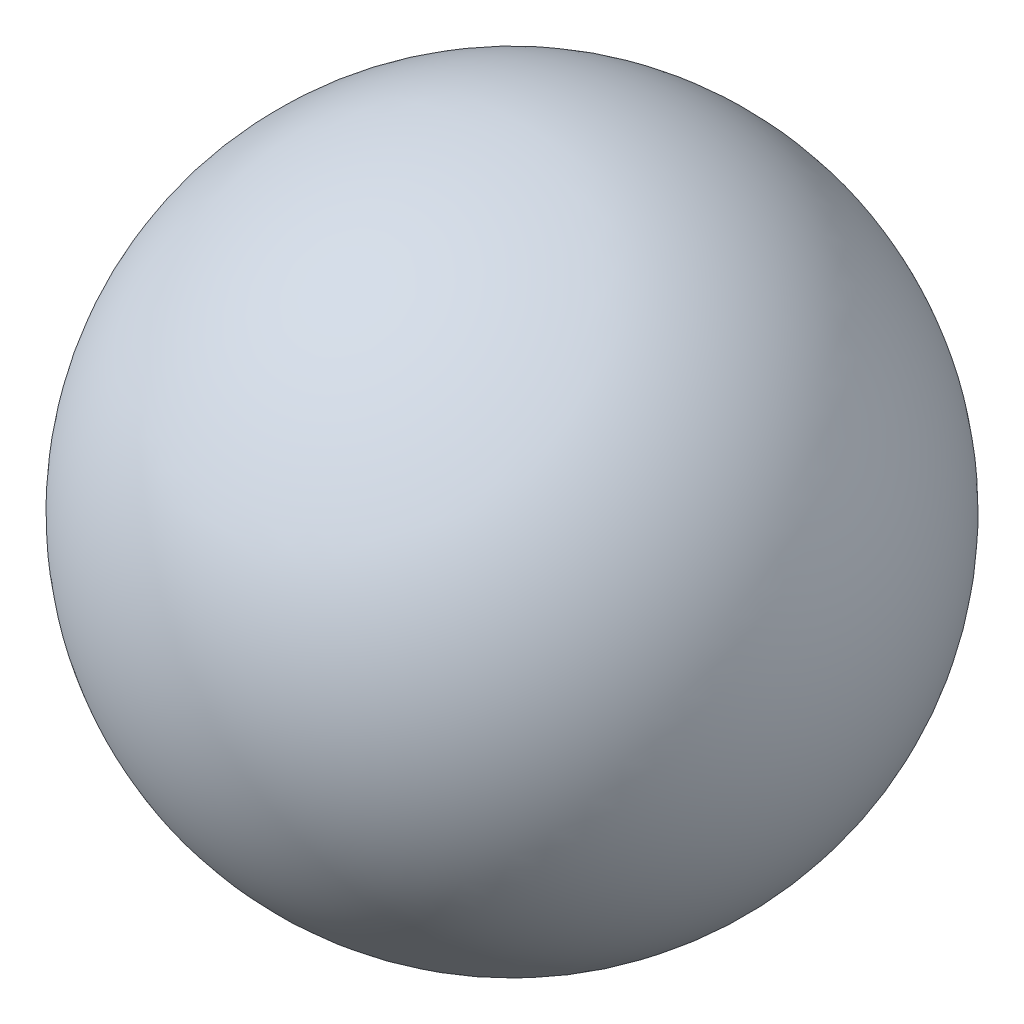
ISO-10303-21;
HEADER;
FILE_DESCRIPTION(('STEP AP214'),'2;1');
FILE_NAME('part.step','',(''),(''),'','','');
FILE_SCHEMA(('AUTOMOTIVE_DESIGN { 1 0 10303 214 1 1 1 1 }'));
ENDSEC;
DATA;
#1=APPLICATION_CONTEXT('core data for automotive mechanical design processes');
#2=APPLICATION_PROTOCOL_DEFINITION('international standard','automotive_design',2000,#1);
#3=PRODUCT_CONTEXT('',#1,'mechanical');
#4=PRODUCT('Part','Part','',(#3));
#5=PRODUCT_RELATED_PRODUCT_CATEGORY('part','',(#4));
#6=PRODUCT_DEFINITION_FORMATION('','',#4);
#7=PRODUCT_DEFINITION_CONTEXT('part definition',#1,'design');
#8=PRODUCT_DEFINITION('design','',#6,#7);
#9=PRODUCT_DEFINITION_SHAPE('','',#8);
#10=(LENGTH_UNIT() NAMED_UNIT(*) SI_UNIT(.MILLI.,.METRE.));
#11=(NAMED_UNIT(*) PLANE_ANGLE_UNIT() SI_UNIT($,.RADIAN.));
#12=(NAMED_UNIT(*) SI_UNIT($,.STERADIAN.) SOLID_ANGLE_UNIT());
#13=UNCERTAINTY_MEASURE_WITH_UNIT(LENGTH_MEASURE(1.E-05),#10,'distance_accuracy_value','');
#14=(GEOMETRIC_REPRESENTATION_CONTEXT(3) GLOBAL_UNCERTAINTY_ASSIGNED_CONTEXT((#13)) GLOBAL_UNIT_ASSIGNED_CONTEXT((#10,
#11,#12)) REPRESENTATION_CONTEXT('',''));
#15=CARTESIAN_POINT('',(0.,0.,0.));
#16=DIRECTION('',(0.,0.,1.));
#17=DIRECTION('',(1.,0.,0.));
#18=AXIS2_PLACEMENT_3D('',#15,#16,#17);
#19=CARTESIAN_POINT('',(2.22370212123478,-2.,11.5376621928368));
#20=DIRECTION('',(0.,0.,1.));
#21=DIRECTION('',(1.,0.,0.));
#22=AXIS2_PLACEMENT_3D('',#19,#20,#21);
#23=SPHERICAL_SURFACE('',#22,1.05);
#24=CARTESIAN_POINT('',(2.22370212123478,-2.,12.5876621928368));
#25=VERTEX_POINT('',#24);
#26=VERTEX_LOOP('',#25);
#27=FACE_BOUND('',#26,.T.);
#28=ADVANCED_FACE('F12',(#27),#23,.T.);
#29=CLOSED_SHELL('',(#28));
#30=MANIFOLD_SOLID_BREP('B1',#29);
#31=ADVANCED_BREP_SHAPE_REPRESENTATION('',(#18,#30),#14);
#32=SHAPE_DEFINITION_REPRESENTATION(#9,#31);
ENDSEC;
END-ISO-10303-21;
